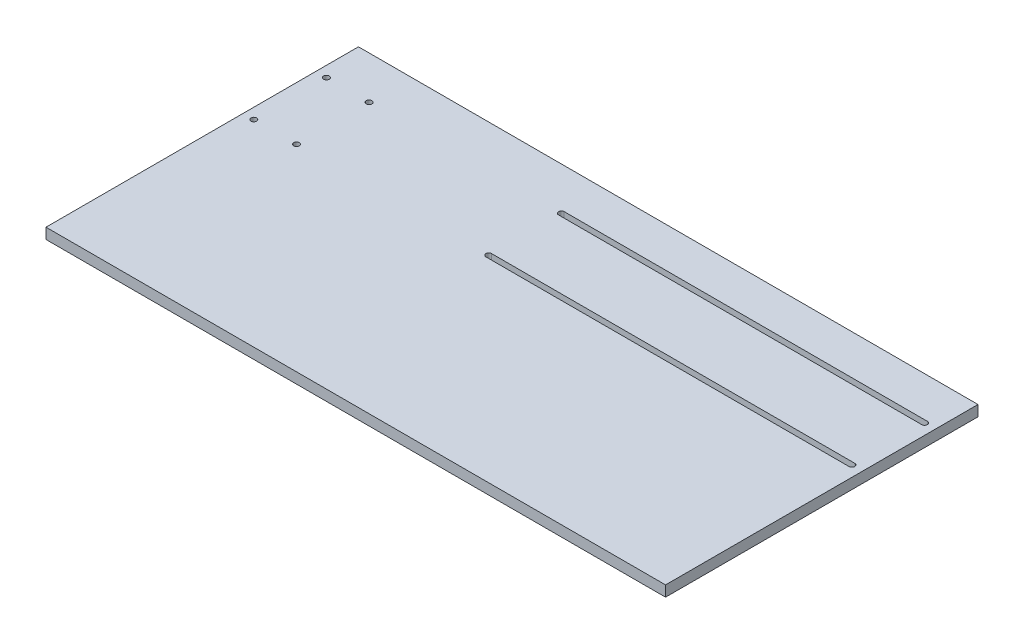
ISO-10303-21;
HEADER;
FILE_DESCRIPTION(('STEP AP214'),'2;1');
FILE_NAME('part.step','',(''),(''),'','','');
FILE_SCHEMA(('AUTOMOTIVE_DESIGN { 1 0 10303 214 1 1 1 1 }'));
ENDSEC;
DATA;
#1=APPLICATION_CONTEXT('core data for automotive mechanical design processes');
#2=APPLICATION_PROTOCOL_DEFINITION('international standard','automotive_design',2000,#1);
#3=PRODUCT_CONTEXT('',#1,'mechanical');
#4=PRODUCT('Part','Part','',(#3));
#5=PRODUCT_RELATED_PRODUCT_CATEGORY('part','',(#4));
#6=PRODUCT_DEFINITION_FORMATION('','',#4);
#7=PRODUCT_DEFINITION_CONTEXT('part definition',#1,'design');
#8=PRODUCT_DEFINITION('design','',#6,#7);
#9=PRODUCT_DEFINITION_SHAPE('','',#8);
#10=(LENGTH_UNIT() NAMED_UNIT(*) SI_UNIT(.MILLI.,.METRE.));
#11=(NAMED_UNIT(*) PLANE_ANGLE_UNIT() SI_UNIT($,.RADIAN.));
#12=(NAMED_UNIT(*) SI_UNIT($,.STERADIAN.) SOLID_ANGLE_UNIT());
#13=UNCERTAINTY_MEASURE_WITH_UNIT(LENGTH_MEASURE(1.E-05),#10,'distance_accuracy_value','');
#14=(GEOMETRIC_REPRESENTATION_CONTEXT(3) GLOBAL_UNCERTAINTY_ASSIGNED_CONTEXT((#13)) GLOBAL_UNIT_ASSIGNED_CONTEXT((#10,
#11,#12)) REPRESENTATION_CONTEXT('',''));
#15=CARTESIAN_POINT('',(0.,0.,0.));
#16=DIRECTION('',(0.,0.,1.));
#17=DIRECTION('',(1.,0.,0.));
#18=AXIS2_PLACEMENT_3D('',#15,#16,#17);
#19=CARTESIAN_POINT('',(368.3,12.7,185.7375));
#20=DIRECTION('',(-1.,0.,0.));
#21=DIRECTION('',(0.,0.,1.));
#22=AXIS2_PLACEMENT_3D('',#19,#20,#21);
#23=PLANE('',#22);
#24=DIRECTION('',(0.,0.,-1.));
#25=VECTOR('',#24,1.);
#26=CARTESIAN_POINT('',(368.3,0.,185.7375));
#27=LINE('',#26,#25);
#28=CARTESIAN_POINT('',(368.3,0.,185.7375));
#29=VERTEX_POINT('',#28);
#30=CARTESIAN_POINT('',(368.3,0.,-185.7375));
#31=VERTEX_POINT('',#30);
#32=EDGE_CURVE('E214',#29,#31,#27,.T.);
#33=ORIENTED_EDGE('',*,*,#32,.T.);
#34=DIRECTION('',(0.,-1.,0.));
#35=VECTOR('',#34,1.);
#36=CARTESIAN_POINT('',(368.3,12.7,-185.7375));
#37=LINE('',#36,#35);
#38=CARTESIAN_POINT('',(368.3,12.7,-185.7375));
#39=VERTEX_POINT('',#38);
#40=EDGE_CURVE('E11',#39,#31,#37,.T.);
#41=ORIENTED_EDGE('',*,*,#40,.F.);
#42=DIRECTION('',(0.,0.,-1.));
#43=VECTOR('',#42,1.);
#44=CARTESIAN_POINT('',(368.3,12.7,185.7375));
#45=LINE('',#44,#43);
#46=CARTESIAN_POINT('',(368.3,12.7,185.7375));
#47=VERTEX_POINT('',#46);
#48=EDGE_CURVE('E217',#47,#39,#45,.T.);
#49=ORIENTED_EDGE('',*,*,#48,.F.);
#50=DIRECTION('',(0.,-1.,0.));
#51=VECTOR('',#50,1.);
#52=CARTESIAN_POINT('',(368.3,12.7,185.7375));
#53=LINE('',#52,#51);
#54=EDGE_CURVE('E229',#47,#29,#53,.T.);
#55=ORIENTED_EDGE('',*,*,#54,.T.);
#56=EDGE_LOOP('',(#33,#41,#49,#55));
#57=FACE_BOUND('',#56,.T.);
#58=ADVANCED_FACE('F35',(#57),#23,.F.);
#59=CARTESIAN_POINT('',(368.3,12.7,-185.7375));
#60=DIRECTION('',(0.,0.,1.));
#61=DIRECTION('',(1.,0.,0.));
#62=AXIS2_PLACEMENT_3D('',#59,#60,#61);
#63=PLANE('',#62);
#64=DIRECTION('',(-1.,0.,0.));
#65=VECTOR('',#64,1.);
#66=CARTESIAN_POINT('',(368.3,0.,-185.7375));
#67=LINE('',#66,#65);
#68=CARTESIAN_POINT('',(-368.3,0.,-185.7375));
#69=VERTEX_POINT('',#68);
#70=EDGE_CURVE('E232',#31,#69,#67,.T.);
#71=ORIENTED_EDGE('',*,*,#70,.T.);
#72=DIRECTION('',(0.,-1.,0.));
#73=VECTOR('',#72,1.);
#74=CARTESIAN_POINT('',(-368.3,12.7,-185.7375));
#75=LINE('',#74,#73);
#76=CARTESIAN_POINT('',(-368.3,12.7,-185.7375));
#77=VERTEX_POINT('',#76);
#78=EDGE_CURVE('E42',#77,#69,#75,.T.);
#79=ORIENTED_EDGE('',*,*,#78,.F.);
#80=DIRECTION('',(-1.,0.,0.));
#81=VECTOR('',#80,1.);
#82=CARTESIAN_POINT('',(368.3,12.7,-185.7375));
#83=LINE('',#82,#81);
#84=EDGE_CURVE('E220',#39,#77,#83,.T.);
#85=ORIENTED_EDGE('',*,*,#84,.F.);
#86=ORIENTED_EDGE('',*,*,#40,.T.);
#87=EDGE_LOOP('',(#71,#79,#85,#86));
#88=FACE_BOUND('',#87,.T.);
#89=ADVANCED_FACE('F248',(#88),#63,.F.);
#90=CARTESIAN_POINT('',(-368.3,12.7,185.7375));
#91=DIRECTION('',(-1.,0.,0.));
#92=DIRECTION('',(0.,0.,1.));
#93=AXIS2_PLACEMENT_3D('',#90,#91,#92);
#94=PLANE('',#93);
#95=DIRECTION('',(0.,0.,-1.));
#96=VECTOR('',#95,1.);
#97=CARTESIAN_POINT('',(-368.3,0.,185.7375));
#98=LINE('',#97,#96);
#99=CARTESIAN_POINT('',(-368.3,0.,185.7375));
#100=VERTEX_POINT('',#99);
#101=EDGE_CURVE('E235',#100,#69,#98,.T.);
#102=ORIENTED_EDGE('',*,*,#101,.F.);
#103=DIRECTION('',(0.,-1.,0.));
#104=VECTOR('',#103,1.);
#105=CARTESIAN_POINT('',(-368.3,12.7,185.7375));
#106=LINE('',#105,#104);
#107=CARTESIAN_POINT('',(-368.3,12.7,185.7375));
#108=VERTEX_POINT('',#107);
#109=EDGE_CURVE('E241',#108,#100,#106,.T.);
#110=ORIENTED_EDGE('',*,*,#109,.F.);
#111=DIRECTION('',(0.,0.,-1.));
#112=VECTOR('',#111,1.);
#113=CARTESIAN_POINT('',(-368.3,12.7,185.7375));
#114=LINE('',#113,#112);
#115=EDGE_CURVE('E223',#108,#77,#114,.T.);
#116=ORIENTED_EDGE('',*,*,#115,.T.);
#117=ORIENTED_EDGE('',*,*,#78,.T.);
#118=EDGE_LOOP('',(#102,#110,#116,#117));
#119=FACE_BOUND('',#118,.T.);
#120=ADVANCED_FACE('F245',(#119),#94,.T.);
#121=CARTESIAN_POINT('',(368.3,12.7,185.7375));
#122=DIRECTION('',(0.,0.,1.));
#123=DIRECTION('',(1.,0.,0.));
#124=AXIS2_PLACEMENT_3D('',#121,#122,#123);
#125=PLANE('',#124);
#126=DIRECTION('',(-1.,0.,0.));
#127=VECTOR('',#126,1.);
#128=CARTESIAN_POINT('',(368.3,0.,185.7375));
#129=LINE('',#128,#127);
#130=EDGE_CURVE('E221',#29,#100,#129,.T.);
#131=ORIENTED_EDGE('',*,*,#130,.F.);
#132=ORIENTED_EDGE('',*,*,#54,.F.);
#133=DIRECTION('',(-1.,0.,0.));
#134=VECTOR('',#133,1.);
#135=CARTESIAN_POINT('',(368.3,12.7,185.7375));
#136=LINE('',#135,#134);
#137=EDGE_CURVE('E226',#47,#108,#136,.T.);
#138=ORIENTED_EDGE('',*,*,#137,.T.);
#139=ORIENTED_EDGE('',*,*,#109,.T.);
#140=EDGE_LOOP('',(#131,#132,#138,#139));
#141=FACE_BOUND('',#140,.T.);
#142=ADVANCED_FACE('F254',(#141),#125,.T.);
#143=CARTESIAN_POINT('',(0.,12.7,0.));
#144=DIRECTION('',(0.,1.,0.));
#145=DIRECTION('',(0.,0.,1.));
#146=AXIS2_PLACEMENT_3D('',#143,#144,#145);
#147=PLANE('',#146);
#148=CARTESIAN_POINT('',(-355.6,12.7,-48.5775000000001));
#149=DIRECTION('',(0.,1.,0.));
#150=DIRECTION('',(0.,0.,1.));
#151=AXIS2_PLACEMENT_3D('',#148,#149,#150);
#152=CIRCLE('',#151,3.37819999999999);
#153=CARTESIAN_POINT('',(-355.6,12.7,-45.1993000000001));
#154=VERTEX_POINT('',#153);
#155=EDGE_CURVE('E166',#154,#154,#152,.T.);
#156=ORIENTED_EDGE('',*,*,#155,.F.);
#157=EDGE_LOOP('',(#156));
#158=FACE_BOUND('',#157,.T.);
#159=CARTESIAN_POINT('',(-304.8,12.7,-48.5775000000001));
#160=DIRECTION('',(0.,1.,0.));
#161=DIRECTION('',(0.,0.,1.));
#162=AXIS2_PLACEMENT_3D('',#159,#160,#161);
#163=CIRCLE('',#162,3.37819999999999);
#164=CARTESIAN_POINT('',(-304.8,12.7,-45.1993000000001));
#165=VERTEX_POINT('',#164);
#166=EDGE_CURVE('E172',#165,#165,#163,.T.);
#167=ORIENTED_EDGE('',*,*,#166,.F.);
#168=EDGE_LOOP('',(#167));
#169=FACE_BOUND('',#168,.T.);
#170=CARTESIAN_POINT('',(-304.8,12.7,-134.9375));
#171=DIRECTION('',(0.,1.,0.));
#172=DIRECTION('',(0.,0.,1.));
#173=AXIS2_PLACEMENT_3D('',#170,#171,#172);
#174=CIRCLE('',#173,3.37819999999999);
#175=CARTESIAN_POINT('',(-304.8,12.7,-131.5593));
#176=VERTEX_POINT('',#175);
#177=EDGE_CURVE('E178',#176,#176,#174,.T.);
#178=ORIENTED_EDGE('',*,*,#177,.F.);
#179=EDGE_LOOP('',(#178));
#180=FACE_BOUND('',#179,.T.);
#181=CARTESIAN_POINT('',(-76.1999999999999,12.7,-134.9375));
#182=DIRECTION('',(0.,1.,0.));
#183=DIRECTION('',(0.,0.,1.));
#184=AXIS2_PLACEMENT_3D('',#181,#182,#183);
#185=CIRCLE('',#184,3.3782);
#186=CARTESIAN_POINT('',(-76.1999999999999,12.7,-138.3157));
#187=VERTEX_POINT('',#186);
#188=CARTESIAN_POINT('',(-76.1999999999999,12.7,-131.5593));
#189=VERTEX_POINT('',#188);
#190=EDGE_CURVE('E49',#187,#189,#185,.T.);
#191=ORIENTED_EDGE('',*,*,#190,.F.);
#192=DIRECTION('',(-1.,0.,0.));
#193=VECTOR('',#192,1.);
#194=CARTESIAN_POINT('',(-76.1999999999999,12.7,-138.3157));
#195=LINE('',#194,#193);
#196=CARTESIAN_POINT('',(355.6,12.7,-138.3157));
#197=VERTEX_POINT('',#196);
#198=EDGE_CURVE('E186',#197,#187,#195,.T.);
#199=ORIENTED_EDGE('',*,*,#198,.F.);
#200=CARTESIAN_POINT('',(355.6,12.7,-134.9375));
#201=DIRECTION('',(0.,1.,0.));
#202=DIRECTION('',(0.,0.,1.));
#203=AXIS2_PLACEMENT_3D('',#200,#201,#202);
#204=CIRCLE('',#203,3.37819999999997);
#205=CARTESIAN_POINT('',(355.6,12.7,-131.5593));
#206=VERTEX_POINT('',#205);
#207=EDGE_CURVE('E200',#206,#197,#204,.T.);
#208=ORIENTED_EDGE('',*,*,#207,.F.);
#209=DIRECTION('',(1.,0.,0.));
#210=VECTOR('',#209,1.);
#211=CARTESIAN_POINT('',(-76.1999999999999,12.7,-131.5593));
#212=LINE('',#211,#210);
#213=EDGE_CURVE('E197',#189,#206,#212,.T.);
#214=ORIENTED_EDGE('',*,*,#213,.F.);
#215=EDGE_LOOP('',(#191,#199,#208,#214));
#216=FACE_BOUND('',#215,.T.);
#217=CARTESIAN_POINT('',(-76.1999999999999,12.7,-48.5775000000001));
#218=DIRECTION('',(0.,1.,0.));
#219=DIRECTION('',(0.,0.,1.));
#220=AXIS2_PLACEMENT_3D('',#217,#218,#219);
#221=CIRCLE('',#220,3.3782);
#222=CARTESIAN_POINT('',(-76.1999999999999,12.7,-51.9557000000001));
#223=VERTEX_POINT('',#222);
#224=CARTESIAN_POINT('',(-76.1999999999999,12.7,-45.1993000000001));
#225=VERTEX_POINT('',#224);
#226=EDGE_CURVE('E57',#223,#225,#221,.T.);
#227=ORIENTED_EDGE('',*,*,#226,.F.);
#228=DIRECTION('',(-1.,0.,0.));
#229=VECTOR('',#228,1.);
#230=CARTESIAN_POINT('',(-76.1999999999999,12.7,-51.9557000000001));
#231=LINE('',#230,#229);
#232=CARTESIAN_POINT('',(355.6,12.7,-51.9557000000001));
#233=VERTEX_POINT('',#232);
#234=EDGE_CURVE('E144',#233,#223,#231,.T.);
#235=ORIENTED_EDGE('',*,*,#234,.F.);
#236=CARTESIAN_POINT('',(355.6,12.7,-48.5775000000001));
#237=DIRECTION('',(0.,1.,0.));
#238=DIRECTION('',(0.,0.,1.));
#239=AXIS2_PLACEMENT_3D('',#236,#237,#238);
#240=CIRCLE('',#239,3.3782);
#241=CARTESIAN_POINT('',(355.6,12.7,-45.1993000000001));
#242=VERTEX_POINT('',#241);
#243=EDGE_CURVE('E147',#242,#233,#240,.T.);
#244=ORIENTED_EDGE('',*,*,#243,.F.);
#245=DIRECTION('',(1.,0.,0.));
#246=VECTOR('',#245,1.);
#247=CARTESIAN_POINT('',(-76.1999999999999,12.7,-45.1993000000001));
#248=LINE('',#247,#246);
#249=EDGE_CURVE('E153',#225,#242,#248,.T.);
#250=ORIENTED_EDGE('',*,*,#249,.F.);
#251=EDGE_LOOP('',(#227,#235,#244,#250));
#252=FACE_BOUND('',#251,.T.);
#253=CARTESIAN_POINT('',(-355.6,12.7,-134.9375));
#254=DIRECTION('',(0.,1.,0.));
#255=DIRECTION('',(0.,0.,1.));
#256=AXIS2_PLACEMENT_3D('',#253,#254,#255);
#257=CIRCLE('',#256,3.37819999999999);
#258=CARTESIAN_POINT('',(-355.6,12.7,-131.5593));
#259=VERTEX_POINT('',#258);
#260=EDGE_CURVE('E165',#259,#259,#257,.T.);
#261=ORIENTED_EDGE('',*,*,#260,.F.);
#262=EDGE_LOOP('',(#261));
#263=FACE_BOUND('',#262,.T.);
#264=ORIENTED_EDGE('',*,*,#48,.T.);
#265=ORIENTED_EDGE('',*,*,#84,.T.);
#266=ORIENTED_EDGE('',*,*,#115,.F.);
#267=ORIENTED_EDGE('',*,*,#137,.F.);
#268=EDGE_LOOP('',(#264,#265,#266,#267));
#269=FACE_BOUND('',#268,.T.);
#270=ADVANCED_FACE('F258',(#158,#169,#180,#216,#252,#263,#269),#147,.T.);
#271=CARTESIAN_POINT('',(0.,0.,0.));
#272=DIRECTION('',(0.,1.,0.));
#273=DIRECTION('',(0.,0.,1.));
#274=AXIS2_PLACEMENT_3D('',#271,#272,#273);
#275=PLANE('',#274);
#276=CARTESIAN_POINT('',(-355.6,0.,-48.5775000000001));
#277=DIRECTION('',(0.,1.,0.));
#278=DIRECTION('',(0.,0.,1.));
#279=AXIS2_PLACEMENT_3D('',#276,#277,#278);
#280=CIRCLE('',#279,3.37819999999999);
#281=CARTESIAN_POINT('',(-355.6,0.,-45.1993000000001));
#282=VERTEX_POINT('',#281);
#283=EDGE_CURVE('E162',#282,#282,#280,.T.);
#284=ORIENTED_EDGE('',*,*,#283,.T.);
#285=EDGE_LOOP('',(#284));
#286=FACE_BOUND('',#285,.T.);
#287=CARTESIAN_POINT('',(-304.8,0.,-48.5775000000001));
#288=DIRECTION('',(0.,1.,0.));
#289=DIRECTION('',(0.,0.,1.));
#290=AXIS2_PLACEMENT_3D('',#287,#288,#289);
#291=CIRCLE('',#290,3.37819999999999);
#292=CARTESIAN_POINT('',(-304.8,0.,-45.1993000000001));
#293=VERTEX_POINT('',#292);
#294=EDGE_CURVE('E169',#293,#293,#291,.T.);
#295=ORIENTED_EDGE('',*,*,#294,.T.);
#296=EDGE_LOOP('',(#295));
#297=FACE_BOUND('',#296,.T.);
#298=CARTESIAN_POINT('',(-304.8,0.,-134.9375));
#299=DIRECTION('',(0.,1.,0.));
#300=DIRECTION('',(0.,0.,1.));
#301=AXIS2_PLACEMENT_3D('',#298,#299,#300);
#302=CIRCLE('',#301,3.37819999999999);
#303=CARTESIAN_POINT('',(-304.8,0.,-131.5593));
#304=VERTEX_POINT('',#303);
#305=EDGE_CURVE('E175',#304,#304,#302,.T.);
#306=ORIENTED_EDGE('',*,*,#305,.T.);
#307=EDGE_LOOP('',(#306));
#308=FACE_BOUND('',#307,.T.);
#309=DIRECTION('',(-1.,0.,0.));
#310=VECTOR('',#309,1.);
#311=CARTESIAN_POINT('',(-76.1999999999999,0.,-138.3157));
#312=LINE('',#311,#310);
#313=CARTESIAN_POINT('',(355.6,0.,-138.3157));
#314=VERTEX_POINT('',#313);
#315=CARTESIAN_POINT('',(-76.1999999999999,0.,-138.3157));
#316=VERTEX_POINT('',#315);
#317=EDGE_CURVE('E192',#314,#316,#312,.T.);
#318=ORIENTED_EDGE('',*,*,#317,.T.);
#319=CARTESIAN_POINT('',(-76.1999999999999,0.,-134.9375));
#320=DIRECTION('',(0.,1.,0.));
#321=DIRECTION('',(0.,0.,1.));
#322=AXIS2_PLACEMENT_3D('',#319,#320,#321);
#323=CIRCLE('',#322,3.3782);
#324=CARTESIAN_POINT('',(-76.1999999999999,0.,-131.5593));
#325=VERTEX_POINT('',#324);
#326=EDGE_CURVE('E182',#316,#325,#323,.T.);
#327=ORIENTED_EDGE('',*,*,#326,.T.);
#328=DIRECTION('',(1.,0.,0.));
#329=VECTOR('',#328,1.);
#330=CARTESIAN_POINT('',(-76.1999999999999,0.,-131.5593));
#331=LINE('',#330,#329);
#332=CARTESIAN_POINT('',(355.6,0.,-131.5593));
#333=VERTEX_POINT('',#332);
#334=EDGE_CURVE('E185',#325,#333,#331,.T.);
#335=ORIENTED_EDGE('',*,*,#334,.T.);
#336=CARTESIAN_POINT('',(355.6,0.,-134.9375));
#337=DIRECTION('',(0.,1.,0.));
#338=DIRECTION('',(0.,0.,1.));
#339=AXIS2_PLACEMENT_3D('',#336,#337,#338);
#340=CIRCLE('',#339,3.37819999999997);
#341=EDGE_CURVE('E189',#333,#314,#340,.T.);
#342=ORIENTED_EDGE('',*,*,#341,.T.);
#343=EDGE_LOOP('',(#318,#327,#335,#342));
#344=FACE_BOUND('',#343,.T.);
#345=DIRECTION('',(-1.,0.,0.));
#346=VECTOR('',#345,1.);
#347=CARTESIAN_POINT('',(-76.1999999999999,0.,-51.9557000000001));
#348=LINE('',#347,#346);
#349=CARTESIAN_POINT('',(355.6,0.,-51.9557000000001));
#350=VERTEX_POINT('',#349);
#351=CARTESIAN_POINT('',(-76.1999999999999,0.,-51.9557000000001));
#352=VERTEX_POINT('',#351);
#353=EDGE_CURVE('E131',#350,#352,#348,.T.);
#354=ORIENTED_EDGE('',*,*,#353,.T.);
#355=CARTESIAN_POINT('',(-76.1999999999999,0.,-48.5775000000001));
#356=DIRECTION('',(0.,1.,0.));
#357=DIRECTION('',(0.,0.,1.));
#358=AXIS2_PLACEMENT_3D('',#355,#356,#357);
#359=CIRCLE('',#358,3.3782);
#360=CARTESIAN_POINT('',(-76.1999999999999,0.,-45.1993000000001));
#361=VERTEX_POINT('',#360);
#362=EDGE_CURVE('E125',#352,#361,#359,.T.);
#363=ORIENTED_EDGE('',*,*,#362,.T.);
#364=DIRECTION('',(1.,0.,0.));
#365=VECTOR('',#364,1.);
#366=CARTESIAN_POINT('',(-76.1999999999999,0.,-45.1993000000001));
#367=LINE('',#366,#365);
#368=CARTESIAN_POINT('',(355.6,0.,-45.1993000000001));
#369=VERTEX_POINT('',#368);
#370=EDGE_CURVE('E135',#361,#369,#367,.T.);
#371=ORIENTED_EDGE('',*,*,#370,.T.);
#372=CARTESIAN_POINT('',(355.6,0.,-48.5775000000001));
#373=DIRECTION('',(0.,1.,0.));
#374=DIRECTION('',(0.,0.,1.));
#375=AXIS2_PLACEMENT_3D('',#372,#373,#374);
#376=CIRCLE('',#375,3.3782);
#377=EDGE_CURVE('E139',#369,#350,#376,.T.);
#378=ORIENTED_EDGE('',*,*,#377,.T.);
#379=EDGE_LOOP('',(#354,#363,#371,#378));
#380=FACE_BOUND('',#379,.T.);
#381=CARTESIAN_POINT('',(-355.6,0.,-134.9375));
#382=DIRECTION('',(0.,1.,0.));
#383=DIRECTION('',(0.,0.,1.));
#384=AXIS2_PLACEMENT_3D('',#381,#382,#383);
#385=CIRCLE('',#384,3.37819999999999);
#386=CARTESIAN_POINT('',(-355.6,0.,-131.5593));
#387=VERTEX_POINT('',#386);
#388=EDGE_CURVE('E211',#387,#387,#385,.T.);
#389=ORIENTED_EDGE('',*,*,#388,.T.);
#390=EDGE_LOOP('',(#389));
#391=FACE_BOUND('',#390,.T.);
#392=ORIENTED_EDGE('',*,*,#32,.F.);
#393=ORIENTED_EDGE('',*,*,#130,.T.);
#394=ORIENTED_EDGE('',*,*,#101,.T.);
#395=ORIENTED_EDGE('',*,*,#70,.F.);
#396=EDGE_LOOP('',(#392,#393,#394,#395));
#397=FACE_BOUND('',#396,.T.);
#398=ADVANCED_FACE('F141',(#286,#297,#308,#344,#380,#391,#397),#275,.F.);
#399=CARTESIAN_POINT('',(-355.6,0.,-134.9375));
#400=DIRECTION('',(0.,1.,0.));
#401=DIRECTION('',(0.,0.,1.));
#402=AXIS2_PLACEMENT_3D('',#399,#400,#401);
#403=CYLINDRICAL_SURFACE('',#402,3.37819999999999);
#404=ORIENTED_EDGE('',*,*,#388,.F.);
#405=EDGE_LOOP('',(#404));
#406=FACE_BOUND('',#405,.T.);
#407=ORIENTED_EDGE('',*,*,#260,.T.);
#408=EDGE_LOOP('',(#407));
#409=FACE_BOUND('',#408,.T.);
#410=ADVANCED_FACE('F273',(#406,#409),#403,.F.);
#411=CARTESIAN_POINT('',(-76.1999999999999,0.,-48.5775000000001));
#412=DIRECTION('',(0.,1.,0.));
#413=DIRECTION('',(0.,0.,1.));
#414=AXIS2_PLACEMENT_3D('',#411,#412,#413);
#415=CYLINDRICAL_SURFACE('',#414,3.3782);
#416=ORIENTED_EDGE('',*,*,#226,.T.);
#417=DIRECTION('',(0.,1.,0.));
#418=VECTOR('',#417,1.);
#419=CARTESIAN_POINT('',(-76.1999999999999,0.,-45.1993000000001));
#420=LINE('',#419,#418);
#421=EDGE_CURVE('E121',#361,#225,#420,.T.);
#422=ORIENTED_EDGE('',*,*,#421,.F.);
#423=ORIENTED_EDGE('',*,*,#362,.F.);
#424=DIRECTION('',(0.,1.,0.));
#425=VECTOR('',#424,1.);
#426=CARTESIAN_POINT('',(-76.1999999999999,0.,-51.9557000000001));
#427=LINE('',#426,#425);
#428=EDGE_CURVE('E157',#352,#223,#427,.T.);
#429=ORIENTED_EDGE('',*,*,#428,.T.);
#430=EDGE_LOOP('',(#416,#422,#423,#429));
#431=FACE_BOUND('',#430,.T.);
#432=ADVANCED_FACE('F123',(#431),#415,.F.);
#433=CARTESIAN_POINT('',(-76.1999999999999,0.,-51.9557000000001));
#434=DIRECTION('',(0.,0.,-1.));
#435=DIRECTION('',(-1.,0.,0.));
#436=AXIS2_PLACEMENT_3D('',#433,#434,#435);
#437=PLANE('',#436);
#438=ORIENTED_EDGE('',*,*,#234,.T.);
#439=ORIENTED_EDGE('',*,*,#428,.F.);
#440=ORIENTED_EDGE('',*,*,#353,.F.);
#441=DIRECTION('',(0.,1.,0.));
#442=VECTOR('',#441,1.);
#443=CARTESIAN_POINT('',(355.6,0.,-51.9557000000001));
#444=LINE('',#443,#442);
#445=EDGE_CURVE('E159',#350,#233,#444,.T.);
#446=ORIENTED_EDGE('',*,*,#445,.T.);
#447=EDGE_LOOP('',(#438,#439,#440,#446));
#448=FACE_BOUND('',#447,.T.);
#449=ADVANCED_FACE('F310',(#448),#437,.F.);
#450=CARTESIAN_POINT('',(355.6,0.,-48.5775000000001));
#451=DIRECTION('',(0.,1.,0.));
#452=DIRECTION('',(0.,0.,1.));
#453=AXIS2_PLACEMENT_3D('',#450,#451,#452);
#454=CYLINDRICAL_SURFACE('',#453,3.3782);
#455=ORIENTED_EDGE('',*,*,#243,.T.);
#456=ORIENTED_EDGE('',*,*,#445,.F.);
#457=ORIENTED_EDGE('',*,*,#377,.F.);
#458=DIRECTION('',(0.,1.,0.));
#459=VECTOR('',#458,1.);
#460=CARTESIAN_POINT('',(355.6,0.,-45.1993000000001));
#461=LINE('',#460,#459);
#462=EDGE_CURVE('E130',#369,#242,#461,.T.);
#463=ORIENTED_EDGE('',*,*,#462,.T.);
#464=EDGE_LOOP('',(#455,#456,#457,#463));
#465=FACE_BOUND('',#464,.T.);
#466=ADVANCED_FACE('F313',(#465),#454,.F.);
#467=CARTESIAN_POINT('',(-76.1999999999999,0.,-45.1993000000001));
#468=DIRECTION('',(0.,0.,1.));
#469=DIRECTION('',(1.,0.,0.));
#470=AXIS2_PLACEMENT_3D('',#467,#468,#469);
#471=PLANE('',#470);
#472=ORIENTED_EDGE('',*,*,#249,.T.);
#473=ORIENTED_EDGE('',*,*,#462,.F.);
#474=ORIENTED_EDGE('',*,*,#370,.F.);
#475=ORIENTED_EDGE('',*,*,#421,.T.);
#476=EDGE_LOOP('',(#472,#473,#474,#475));
#477=FACE_BOUND('',#476,.T.);
#478=ADVANCED_FACE('F136',(#477),#471,.F.);
#479=CARTESIAN_POINT('',(-76.1999999999999,0.,-134.9375));
#480=DIRECTION('',(0.,1.,0.));
#481=DIRECTION('',(0.,0.,1.));
#482=AXIS2_PLACEMENT_3D('',#479,#480,#481);
#483=CYLINDRICAL_SURFACE('',#482,3.3782);
#484=ORIENTED_EDGE('',*,*,#190,.T.);
#485=DIRECTION('',(0.,1.,0.));
#486=VECTOR('',#485,1.);
#487=CARTESIAN_POINT('',(-76.1999999999999,0.,-131.5593));
#488=LINE('',#487,#486);
#489=EDGE_CURVE('E195',#325,#189,#488,.T.);
#490=ORIENTED_EDGE('',*,*,#489,.F.);
#491=ORIENTED_EDGE('',*,*,#326,.F.);
#492=DIRECTION('',(0.,1.,0.));
#493=VECTOR('',#492,1.);
#494=CARTESIAN_POINT('',(-76.1999999999999,0.,-138.3157));
#495=LINE('',#494,#493);
#496=EDGE_CURVE('E181',#316,#187,#495,.T.);
#497=ORIENTED_EDGE('',*,*,#496,.T.);
#498=EDGE_LOOP('',(#484,#490,#491,#497));
#499=FACE_BOUND('',#498,.T.);
#500=ADVANCED_FACE('F281',(#499),#483,.F.);
#501=CARTESIAN_POINT('',(-76.1999999999999,0.,-138.3157));
#502=DIRECTION('',(0.,0.,-1.));
#503=DIRECTION('',(-1.,0.,0.));
#504=AXIS2_PLACEMENT_3D('',#501,#502,#503);
#505=PLANE('',#504);
#506=ORIENTED_EDGE('',*,*,#198,.T.);
#507=ORIENTED_EDGE('',*,*,#496,.F.);
#508=ORIENTED_EDGE('',*,*,#317,.F.);
#509=DIRECTION('',(0.,1.,0.));
#510=VECTOR('',#509,1.);
#511=CARTESIAN_POINT('',(355.6,0.,-138.3157));
#512=LINE('',#511,#510);
#513=EDGE_CURVE('E206',#314,#197,#512,.T.);
#514=ORIENTED_EDGE('',*,*,#513,.T.);
#515=EDGE_LOOP('',(#506,#507,#508,#514));
#516=FACE_BOUND('',#515,.T.);
#517=ADVANCED_FACE('F284',(#516),#505,.F.);
#518=CARTESIAN_POINT('',(355.6,0.,-134.9375));
#519=DIRECTION('',(0.,1.,0.));
#520=DIRECTION('',(0.,0.,1.));
#521=AXIS2_PLACEMENT_3D('',#518,#519,#520);
#522=CYLINDRICAL_SURFACE('',#521,3.37819999999997);
#523=ORIENTED_EDGE('',*,*,#207,.T.);
#524=ORIENTED_EDGE('',*,*,#513,.F.);
#525=ORIENTED_EDGE('',*,*,#341,.F.);
#526=DIRECTION('',(0.,1.,0.));
#527=VECTOR('',#526,1.);
#528=CARTESIAN_POINT('',(355.6,0.,-131.5593));
#529=LINE('',#528,#527);
#530=EDGE_CURVE('E208',#333,#206,#529,.T.);
#531=ORIENTED_EDGE('',*,*,#530,.T.);
#532=EDGE_LOOP('',(#523,#524,#525,#531));
#533=FACE_BOUND('',#532,.T.);
#534=ADVANCED_FACE('F289',(#533),#522,.F.);
#535=CARTESIAN_POINT('',(-76.1999999999999,0.,-131.5593));
#536=DIRECTION('',(0.,0.,1.));
#537=DIRECTION('',(1.,0.,0.));
#538=AXIS2_PLACEMENT_3D('',#535,#536,#537);
#539=PLANE('',#538);
#540=ORIENTED_EDGE('',*,*,#213,.T.);
#541=ORIENTED_EDGE('',*,*,#530,.F.);
#542=ORIENTED_EDGE('',*,*,#334,.F.);
#543=ORIENTED_EDGE('',*,*,#489,.T.);
#544=EDGE_LOOP('',(#540,#541,#542,#543));
#545=FACE_BOUND('',#544,.T.);
#546=ADVANCED_FACE('F285',(#545),#539,.F.);
#547=CARTESIAN_POINT('',(-304.8,0.,-134.9375));
#548=DIRECTION('',(0.,1.,0.));
#549=DIRECTION('',(0.,0.,1.));
#550=AXIS2_PLACEMENT_3D('',#547,#548,#549);
#551=CYLINDRICAL_SURFACE('',#550,3.37819999999999);
#552=ORIENTED_EDGE('',*,*,#305,.F.);
#553=EDGE_LOOP('',(#552));
#554=FACE_BOUND('',#553,.T.);
#555=ORIENTED_EDGE('',*,*,#177,.T.);
#556=EDGE_LOOP('',(#555));
#557=FACE_BOUND('',#556,.T.);
#558=ADVANCED_FACE('F288',(#554,#557),#551,.F.);
#559=CARTESIAN_POINT('',(-304.8,0.,-48.5775000000001));
#560=DIRECTION('',(0.,1.,0.));
#561=DIRECTION('',(0.,0.,1.));
#562=AXIS2_PLACEMENT_3D('',#559,#560,#561);
#563=CYLINDRICAL_SURFACE('',#562,3.37819999999999);
#564=ORIENTED_EDGE('',*,*,#294,.F.);
#565=EDGE_LOOP('',(#564));
#566=FACE_BOUND('',#565,.T.);
#567=ORIENTED_EDGE('',*,*,#166,.T.);
#568=EDGE_LOOP('',(#567));
#569=FACE_BOUND('',#568,.T.);
#570=ADVANCED_FACE('F299',(#566,#569),#563,.F.);
#571=CARTESIAN_POINT('',(-355.6,0.,-48.5775000000001));
#572=DIRECTION('',(0.,1.,0.));
#573=DIRECTION('',(0.,0.,1.));
#574=AXIS2_PLACEMENT_3D('',#571,#572,#573);
#575=CYLINDRICAL_SURFACE('',#574,3.37819999999999);
#576=ORIENTED_EDGE('',*,*,#283,.F.);
#577=EDGE_LOOP('',(#576));
#578=FACE_BOUND('',#577,.T.);
#579=ORIENTED_EDGE('',*,*,#155,.T.);
#580=EDGE_LOOP('',(#579));
#581=FACE_BOUND('',#580,.T.);
#582=ADVANCED_FACE('F303',(#578,#581),#575,.F.);
#583=CLOSED_SHELL('',(#58,#89,#120,#142,#270,#398,#410,#432,#449,#466,#478,#500,#517,#534,#546,
#558,#570,#582));
#584=MANIFOLD_SOLID_BREP('B2',#583);
#585=ADVANCED_BREP_SHAPE_REPRESENTATION('',(#18,#584),#14);
#586=SHAPE_DEFINITION_REPRESENTATION(#9,#585);
ENDSEC;
END-ISO-10303-21;
